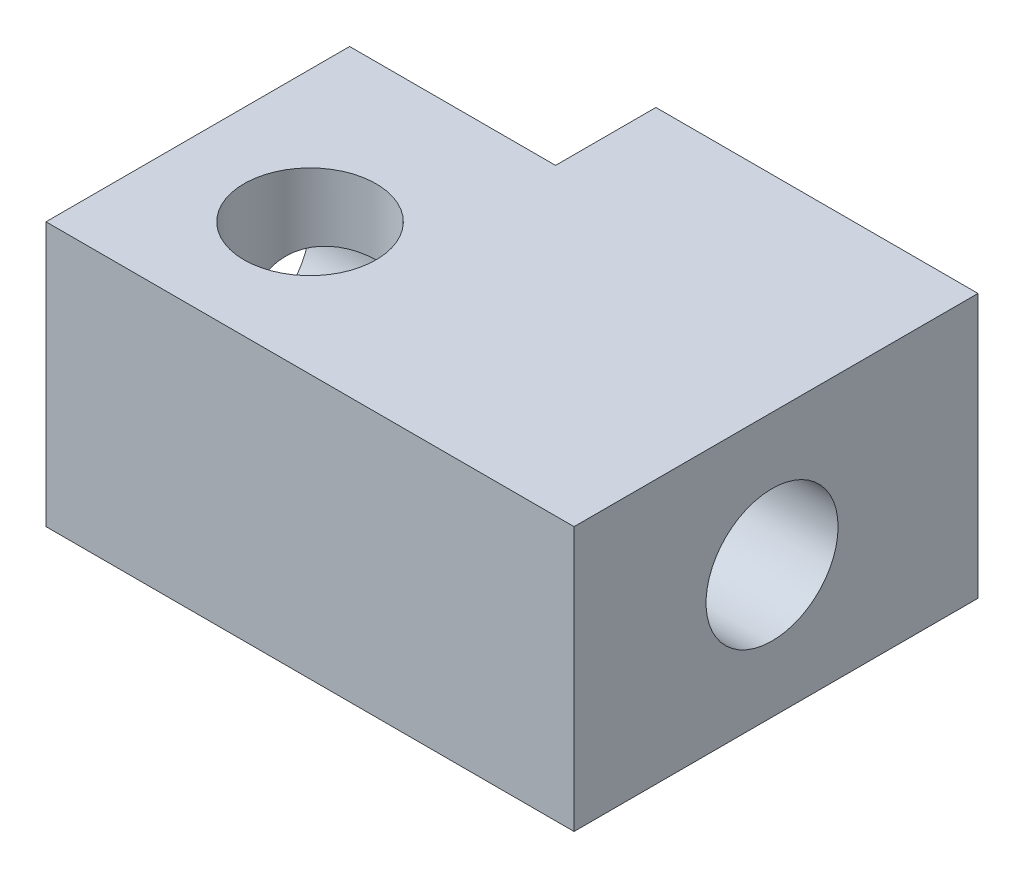
ISO-10303-21;
HEADER;
FILE_DESCRIPTION(('STEP AP214'),'2;1');
FILE_NAME('part.step','',(''),(''),'','','');
FILE_SCHEMA(('AUTOMOTIVE_DESIGN { 1 0 10303 214 1 1 1 1 }'));
ENDSEC;
DATA;
#1=APPLICATION_CONTEXT('core data for automotive mechanical design processes');
#2=APPLICATION_PROTOCOL_DEFINITION('international standard','automotive_design',2000,#1);
#3=PRODUCT_CONTEXT('',#1,'mechanical');
#4=PRODUCT('Part','Part','',(#3));
#5=PRODUCT_RELATED_PRODUCT_CATEGORY('part','',(#4));
#6=PRODUCT_DEFINITION_FORMATION('','',#4);
#7=PRODUCT_DEFINITION_CONTEXT('part definition',#1,'design');
#8=PRODUCT_DEFINITION('design','',#6,#7);
#9=PRODUCT_DEFINITION_SHAPE('','',#8);
#10=(LENGTH_UNIT() NAMED_UNIT(*) SI_UNIT(.MILLI.,.METRE.));
#11=(NAMED_UNIT(*) PLANE_ANGLE_UNIT() SI_UNIT($,.RADIAN.));
#12=(NAMED_UNIT(*) SI_UNIT($,.STERADIAN.) SOLID_ANGLE_UNIT());
#13=UNCERTAINTY_MEASURE_WITH_UNIT(LENGTH_MEASURE(1.E-05),#10,'distance_accuracy_value','');
#14=(GEOMETRIC_REPRESENTATION_CONTEXT(3) GLOBAL_UNCERTAINTY_ASSIGNED_CONTEXT((#13)) GLOBAL_UNIT_ASSIGNED_CONTEXT((#10,
#11,#12)) REPRESENTATION_CONTEXT('',''));
#15=CARTESIAN_POINT('',(0.,0.,0.));
#16=DIRECTION('',(0.,0.,1.));
#17=DIRECTION('',(1.,0.,0.));
#18=AXIS2_PLACEMENT_3D('',#15,#16,#17);
#19=CARTESIAN_POINT('',(89.,5.,0.));
#20=DIRECTION('',(1.,0.,0.));
#21=DIRECTION('',(0.,0.,-1.));
#22=AXIS2_PLACEMENT_3D('',#19,#20,#21);
#23=PLANE('',#22);
#24=CARTESIAN_POINT('',(89.,2.5,84.75));
#25=DIRECTION('',(1.,0.,0.));
#26=DIRECTION('',(0.,0.,-1.));
#27=AXIS2_PLACEMENT_3D('',#24,#25,#26);
#28=CIRCLE('',#27,1.25);
#29=CARTESIAN_POINT('',(89.,2.5,83.5));
#30=VERTEX_POINT('',#29);
#31=EDGE_CURVE('E193',#30,#30,#28,.T.);
#32=ORIENTED_EDGE('',*,*,#31,.F.);
#33=EDGE_LOOP('',(#32));
#34=FACE_BOUND('',#33,.T.);
#35=DIRECTION('',(0.,0.,1.));
#36=VECTOR('',#35,1.);
#37=CARTESIAN_POINT('',(89.,0.,0.));
#38=LINE('',#37,#36);
#39=CARTESIAN_POINT('',(89.,0.,80.85));
#40=VERTEX_POINT('',#39);
#41=CARTESIAN_POINT('',(89.,0.,88.5));
#42=VERTEX_POINT('',#41);
#43=EDGE_CURVE('E131',#40,#42,#38,.T.);
#44=ORIENTED_EDGE('',*,*,#43,.F.);
#45=DIRECTION('',(0.,-1.,0.));
#46=VECTOR('',#45,1.);
#47=CARTESIAN_POINT('',(89.,5.,80.85));
#48=LINE('',#47,#46);
#49=CARTESIAN_POINT('',(89.,5.,80.85));
#50=VERTEX_POINT('',#49);
#51=EDGE_CURVE('E11',#50,#40,#48,.T.);
#52=ORIENTED_EDGE('',*,*,#51,.F.);
#53=DIRECTION('',(0.,0.,1.));
#54=VECTOR('',#53,1.);
#55=CARTESIAN_POINT('',(89.,5.,0.));
#56=LINE('',#55,#54);
#57=CARTESIAN_POINT('',(89.,5.,88.5));
#58=VERTEX_POINT('',#57);
#59=EDGE_CURVE('E199',#50,#58,#56,.T.);
#60=ORIENTED_EDGE('',*,*,#59,.T.);
#61=DIRECTION('',(0.,-1.,0.));
#62=VECTOR('',#61,1.);
#63=CARTESIAN_POINT('',(89.,5.,88.5));
#64=LINE('',#63,#62);
#65=EDGE_CURVE('E88',#58,#42,#64,.T.);
#66=ORIENTED_EDGE('',*,*,#65,.T.);
#67=EDGE_LOOP('',(#44,#52,#60,#66));
#68=FACE_BOUND('',#67,.T.);
#69=ADVANCED_FACE('F36',(#34,#68),#23,.T.);
#70=CARTESIAN_POINT('',(0.,5.,80.85));
#71=DIRECTION('',(0.,0.,-1.));
#72=DIRECTION('',(-1.,0.,0.));
#73=AXIS2_PLACEMENT_3D('',#70,#71,#72);
#74=PLANE('',#73);
#75=DIRECTION('',(1.,0.,0.));
#76=VECTOR('',#75,1.);
#77=CARTESIAN_POINT('',(0.,0.,80.85));
#78=LINE('',#77,#76);
#79=CARTESIAN_POINT('',(82.9,0.,80.85));
#80=VERTEX_POINT('',#79);
#81=EDGE_CURVE('E133',#80,#40,#78,.T.);
#82=ORIENTED_EDGE('',*,*,#81,.F.);
#83=DIRECTION('',(0.,-1.,0.));
#84=VECTOR('',#83,1.);
#85=CARTESIAN_POINT('',(82.9,5.,80.85));
#86=LINE('',#85,#84);
#87=CARTESIAN_POINT('',(82.9,5.,80.85));
#88=VERTEX_POINT('',#87);
#89=EDGE_CURVE('E51',#88,#80,#86,.T.);
#90=ORIENTED_EDGE('',*,*,#89,.F.);
#91=DIRECTION('',(1.,0.,0.));
#92=VECTOR('',#91,1.);
#93=CARTESIAN_POINT('',(0.,5.,80.85));
#94=LINE('',#93,#92);
#95=EDGE_CURVE('E123',#88,#50,#94,.T.);
#96=ORIENTED_EDGE('',*,*,#95,.T.);
#97=ORIENTED_EDGE('',*,*,#51,.T.);
#98=EDGE_LOOP('',(#82,#90,#96,#97));
#99=FACE_BOUND('',#98,.T.);
#100=ADVANCED_FACE('F154',(#99),#74,.T.);
#101=CARTESIAN_POINT('',(82.9,5.,0.));
#102=DIRECTION('',(1.,0.,0.));
#103=DIRECTION('',(0.,0.,-1.));
#104=AXIS2_PLACEMENT_3D('',#101,#102,#103);
#105=PLANE('',#104);
#106=DIRECTION('',(0.,0.,1.));
#107=VECTOR('',#106,1.);
#108=CARTESIAN_POINT('',(82.9,0.,0.));
#109=LINE('',#108,#107);
#110=CARTESIAN_POINT('',(82.9,0.,82.75));
#111=VERTEX_POINT('',#110);
#112=EDGE_CURVE('E136',#80,#111,#109,.T.);
#113=ORIENTED_EDGE('',*,*,#112,.T.);
#114=DIRECTION('',(0.,-1.,0.));
#115=VECTOR('',#114,1.);
#116=CARTESIAN_POINT('',(82.9,5.,82.75));
#117=LINE('',#116,#115);
#118=CARTESIAN_POINT('',(82.9,5.,82.75));
#119=VERTEX_POINT('',#118);
#120=EDGE_CURVE('E110',#119,#111,#117,.T.);
#121=ORIENTED_EDGE('',*,*,#120,.F.);
#122=DIRECTION('',(0.,0.,1.));
#123=VECTOR('',#122,1.);
#124=CARTESIAN_POINT('',(82.9,5.,0.));
#125=LINE('',#124,#123);
#126=EDGE_CURVE('E120',#88,#119,#125,.T.);
#127=ORIENTED_EDGE('',*,*,#126,.F.);
#128=ORIENTED_EDGE('',*,*,#89,.T.);
#129=EDGE_LOOP('',(#113,#121,#127,#128));
#130=FACE_BOUND('',#129,.T.);
#131=ADVANCED_FACE('F149',(#130),#105,.F.);
#132=CARTESIAN_POINT('',(0.,5.,82.75));
#133=DIRECTION('',(0.,0.,-1.));
#134=DIRECTION('',(-1.,0.,0.));
#135=AXIS2_PLACEMENT_3D('',#132,#133,#134);
#136=PLANE('',#135);
#137=DIRECTION('',(1.,0.,0.));
#138=VECTOR('',#137,1.);
#139=CARTESIAN_POINT('',(0.,0.,82.75));
#140=LINE('',#139,#138);
#141=CARTESIAN_POINT('',(79.,0.,82.75));
#142=VERTEX_POINT('',#141);
#143=EDGE_CURVE('E107',#142,#111,#140,.T.);
#144=ORIENTED_EDGE('',*,*,#143,.F.);
#145=DIRECTION('',(0.,-1.,0.));
#146=VECTOR('',#145,1.);
#147=CARTESIAN_POINT('',(79.,5.,82.75));
#148=LINE('',#147,#146);
#149=CARTESIAN_POINT('',(79.,5.,82.75));
#150=VERTEX_POINT('',#149);
#151=EDGE_CURVE('E101',#150,#142,#148,.T.);
#152=ORIENTED_EDGE('',*,*,#151,.F.);
#153=DIRECTION('',(1.,0.,0.));
#154=VECTOR('',#153,1.);
#155=CARTESIAN_POINT('',(0.,5.,82.75));
#156=LINE('',#155,#154);
#157=EDGE_CURVE('E105',#150,#119,#156,.T.);
#158=ORIENTED_EDGE('',*,*,#157,.T.);
#159=ORIENTED_EDGE('',*,*,#120,.T.);
#160=EDGE_LOOP('',(#144,#152,#158,#159));
#161=FACE_BOUND('',#160,.T.);
#162=ADVANCED_FACE('F103',(#161),#136,.T.);
#163=CARTESIAN_POINT('',(79.,5.,0.));
#164=DIRECTION('',(1.,0.,0.));
#165=DIRECTION('',(0.,0.,-1.));
#166=AXIS2_PLACEMENT_3D('',#163,#164,#165);
#167=PLANE('',#166);
#168=CARTESIAN_POINT('',(79.,2.5,84.75));
#169=DIRECTION('',(1.,0.,0.));
#170=DIRECTION('',(0.,0.,-1.));
#171=AXIS2_PLACEMENT_3D('',#168,#169,#170);
#172=CIRCLE('',#171,1.25);
#173=CARTESIAN_POINT('',(79.,2.5,83.5));
#174=VERTEX_POINT('',#173);
#175=EDGE_CURVE('E191',#174,#174,#172,.T.);
#176=ORIENTED_EDGE('',*,*,#175,.T.);
#177=EDGE_LOOP('',(#176));
#178=FACE_BOUND('',#177,.T.);
#179=DIRECTION('',(0.,0.,1.));
#180=VECTOR('',#179,1.);
#181=CARTESIAN_POINT('',(79.,0.,0.));
#182=LINE('',#181,#180);
#183=CARTESIAN_POINT('',(79.,0.,88.5));
#184=VERTEX_POINT('',#183);
#185=EDGE_CURVE('E140',#142,#184,#182,.T.);
#186=ORIENTED_EDGE('',*,*,#185,.T.);
#187=DIRECTION('',(0.,-1.,0.));
#188=VECTOR('',#187,1.);
#189=CARTESIAN_POINT('',(79.,5.,88.5));
#190=LINE('',#189,#188);
#191=CARTESIAN_POINT('',(79.,5.,88.5));
#192=VERTEX_POINT('',#191);
#193=EDGE_CURVE('E111',#192,#184,#190,.T.);
#194=ORIENTED_EDGE('',*,*,#193,.F.);
#195=DIRECTION('',(0.,0.,1.));
#196=VECTOR('',#195,1.);
#197=CARTESIAN_POINT('',(79.,5.,0.));
#198=LINE('',#197,#196);
#199=EDGE_CURVE('E114',#150,#192,#198,.T.);
#200=ORIENTED_EDGE('',*,*,#199,.F.);
#201=ORIENTED_EDGE('',*,*,#151,.T.);
#202=EDGE_LOOP('',(#186,#194,#200,#201));
#203=FACE_BOUND('',#202,.T.);
#204=ADVANCED_FACE('F115',(#178,#203),#167,.F.);
#205=CARTESIAN_POINT('',(81.5000000000009,5.,86.));
#206=DIRECTION('',(0.,-1.,0.));
#207=DIRECTION('',(0.,0.,-1.));
#208=AXIS2_PLACEMENT_3D('',#205,#206,#207);
#209=CYLINDRICAL_SURFACE('',#208,1.25);
#210=CARTESIAN_POINT('',(81.5000000000009,3.75,84.75));
#211=CARTESIAN_POINT('',(81.4303879179771,3.7500033558061,84.7500021347025));
#212=CARTESIAN_POINT('',(81.3607520893775,3.75004170118305,84.7558313770004));
#213=CARTESIAN_POINT('',(81.2233776214595,3.74971562826646,84.7790008984842));
#214=CARTESIAN_POINT('',(81.1556405249972,3.74935089164191,84.7963502712858));
#215=CARTESIAN_POINT('',(81.0239309211144,3.74681223178613,84.8421042621616));
#216=CARTESIAN_POINT('',(80.9599632382152,3.74463604169126,84.8705227084195));
#217=CARTESIAN_POINT('',(80.8378405970693,3.73631466046053,84.9375091377932));
#218=CARTESIAN_POINT('',(80.7796835225878,3.73017092044326,84.9760734070522));
#219=CARTESIAN_POINT('',(80.6733131867562,3.71166627926563,85.0600558017887));
#220=CARTESIAN_POINT('',(80.6247992425869,3.69955884502475,85.1051455344101));
#221=CARTESIAN_POINT('',(80.5367504135997,3.66699666627188,85.200717403511));
#222=CARTESIAN_POINT('',(80.4972009142168,3.64655566235215,85.2511905629941));
#223=CARTESIAN_POINT('',(80.432780674381,3.59934157849851,85.3469924673292));
#224=CARTESIAN_POINT('',(80.4066448044918,3.5738087266144,85.3920865869244));
#225=CARTESIAN_POINT('',(80.3617051656157,3.51530466467924,85.4810868318676));
#226=CARTESIAN_POINT('',(80.3429015945137,3.48233325391342,85.5249929251232));
#227=CARTESIAN_POINT('',(80.3126951216891,3.41167129701442,85.6068025573928));
#228=CARTESIAN_POINT('',(80.3009266541825,3.37436469301847,85.6449064713919));
#229=CARTESIAN_POINT('',(80.2820117652387,3.29452710556952,85.716490897934));
#230=CARTESIAN_POINT('',(80.2748668564855,3.25199441771504,85.7499698945337));
#231=CARTESIAN_POINT('',(80.2633928519259,3.1582338097136,85.814318134905));
#232=CARTESIAN_POINT('',(80.2594124835201,3.1065619286813,85.8446010281685));
#233=CARTESIAN_POINT('',(80.253924793901,2.99931042312478,85.8975065401068));
#234=CARTESIAN_POINT('',(80.252418814643,2.94372869516968,85.9201249967918));
#235=CARTESIAN_POINT('',(80.2504800179322,2.82274720210579,85.9594904995483));
#236=CARTESIAN_POINT('',(80.2502048850909,2.75698867064901,85.9751501386427));
#237=CARTESIAN_POINT('',(80.2499653142809,2.62380822483295,85.9956784117589));
#238=CARTESIAN_POINT('',(80.2500009294372,2.55638602802008,86.0005452004692));
#239=CARTESIAN_POINT('',(80.2499990340441,2.41883941795819,85.9993335565702));
#240=CARTESIAN_POINT('',(80.2499584390909,2.3487185389928,85.9927942534782));
#241=CARTESIAN_POINT('',(80.2503482333396,2.21054143998912,85.9680487393185));
#242=CARTESIAN_POINT('',(80.2507788017529,2.14248601568742,85.9498380900396));
#243=CARTESIAN_POINT('',(80.2536006462434,2.01035190660498,85.902249581801));
#244=CARTESIAN_POINT('',(80.2559937470638,1.94627698252351,85.8728613436709));
#245=CARTESIAN_POINT('',(80.2649934437987,1.82417323358955,85.8038810242477));
#246=CARTESIAN_POINT('',(80.2715983615576,1.76614201139396,85.7642930106933));
#247=CARTESIAN_POINT('',(80.2912111729234,1.66087589652267,85.6788332669613));
#248=CARTESIAN_POINT('',(80.3038824976315,1.61324633060538,85.6333745589749));
#249=CARTESIAN_POINT('',(80.3376608817984,1.52700943350309,85.5373592401222));
#250=CARTESIAN_POINT('',(80.3587540369895,1.48838739674516,85.4868111341065));
#251=CARTESIAN_POINT('',(80.4071278732192,1.42569483722976,85.3912360325712));
#252=CARTESIAN_POINT('',(80.4331601351102,1.40035405930868,85.3464047503039));
#253=CARTESIAN_POINT('',(80.4925538056876,1.35687664120273,85.258124954786));
#254=CARTESIAN_POINT('',(80.5259157889991,1.33874056615512,85.2146765502543));
#255=CARTESIAN_POINT('',(80.5974444640301,1.30956813041756,85.1335877685098));
#256=CARTESIAN_POINT('',(80.6352781255362,1.29821607958066,85.0957639884471));
#257=CARTESIAN_POINT('',(80.7161063517365,1.28004280044354,85.0248566298701));
#258=CARTESIAN_POINT('',(80.7591026229588,1.27322307522254,84.9917746267463));
#259=CARTESIAN_POINT('',(80.8539609749728,1.26230566363697,84.9282160395455));
#260=CARTESIAN_POINT('',(80.9062800841769,1.25856219304606,84.8983621961734));
#261=CARTESIAN_POINT('',(81.0147650771944,1.2534536227878,84.8464534516357));
#262=CARTESIAN_POINT('',(81.0709330202005,1.25208980676652,84.8244027647997));
#263=CARTESIAN_POINT('',(81.1929463513506,1.25036639768356,84.7864174144587));
#264=CARTESIAN_POINT('',(81.2591333554211,1.25015061471084,84.771565676944));
#265=CARTESIAN_POINT('',(81.3930370260497,1.24996763393157,84.752749658674));
#266=CARTESIAN_POINT('',(81.4607539362298,1.2500004759982,84.7487871244107));
#267=CARTESIAN_POINT('',(81.598523850086,1.2499995901791,84.7519144510518));
#268=CARTESIAN_POINT('',(81.6685676216663,1.24996327980412,84.7594309137238));
#269=CARTESIAN_POINT('',(81.8064279917303,1.25045151296893,84.786108011309));
#270=CARTESIAN_POINT('',(81.8742437016072,1.25097627754662,84.8052732340174));
#271=CARTESIAN_POINT('',(82.0056941376746,1.25414747737535,84.8547033903236));
#272=CARTESIAN_POINT('',(82.0693274802368,1.2567946109728,84.8849719756042));
#273=CARTESIAN_POINT('',(82.1903790430181,1.26651155906023,84.955597663157));
#274=CARTESIAN_POINT('',(82.2478002772486,1.27357921739481,84.9959498412971));
#275=CARTESIAN_POINT('',(82.3514864638537,1.29426432070599,85.0825152442898));
#276=CARTESIAN_POINT('',(82.3981878638404,1.30750532176261,85.1282913040849));
#277=CARTESIAN_POINT('',(82.4825454071386,1.34249213800241,85.224637838345));
#278=CARTESIAN_POINT('',(82.5202159173548,1.36422429808701,85.2752005167561));
#279=CARTESIAN_POINT('',(82.5811827113211,1.41373028414858,85.370476848518));
#280=CARTESIAN_POINT('',(82.6057452197654,1.44025655763787,85.4150347952149));
#281=CARTESIAN_POINT('',(82.6477946163517,1.50052783570434,85.5025797802186));
#282=CARTESIAN_POINT('',(82.6652806615349,1.53427369955843,85.5455666308196));
#283=CARTESIAN_POINT('',(82.6934458385397,1.6066691447876,85.6259332987859));
#284=CARTESIAN_POINT('',(82.7043916578275,1.64503607956333,85.6634769604646));
#285=CARTESIAN_POINT('',(82.7218426880378,1.72686928004555,85.7337072277934));
#286=CARTESIAN_POINT('',(82.72834639432,1.77033726775321,85.7663921847646));
#287=CARTESIAN_POINT('',(82.738721291342,1.86630353774615,85.8291473122166));
#288=CARTESIAN_POINT('',(82.7422344697995,1.91927026078922,85.8585590163));
#289=CARTESIAN_POINT('',(82.746977750713,2.02898758021986,85.9094441664789));
#290=CARTESIAN_POINT('',(82.748206632873,2.08574018230667,85.9309133646988));
#291=CARTESIAN_POINT('',(82.7497291750199,2.20876476667335,85.967487964113));
#292=CARTESIAN_POINT('',(82.7498925745441,2.2753607066057,85.9815173891319));
#293=CARTESIAN_POINT('',(82.7500283388499,2.4099455326734,85.9985970916655));
#294=CARTESIAN_POINT('',(82.7500006746444,2.47793462860937,86.0016457031347));
#295=CARTESIAN_POINT('',(82.7499987320161,2.61588728113225,85.9965942638138));
#296=CARTESIAN_POINT('',(82.7500263526798,2.68583682330674,85.9881009540032));
#297=CARTESIAN_POINT('',(82.7494243784368,2.82334632856864,85.9594963411097));
#298=CARTESIAN_POINT('',(82.7487945166503,2.89090530978676,85.9393803217148));
#299=CARTESIAN_POINT('',(82.7452472993218,3.02163651082605,85.8881220793566));
#300=CARTESIAN_POINT('',(82.7423306345141,3.08481004900975,85.856983187436));
#301=CARTESIAN_POINT('',(82.7318635971329,3.20477345591417,85.7847391093132));
#302=CARTESIAN_POINT('',(82.7243159133323,3.26156700623996,85.7436397145574));
#303=CARTESIAN_POINT('',(82.7025343613422,3.36364132852684,85.6560220190676));
#304=CARTESIAN_POINT('',(82.688719128613,3.40940230321813,85.6099636260909));
#305=CARTESIAN_POINT('',(82.6525274308278,3.49186734215067,85.513358208184));
#306=CARTESIAN_POINT('',(82.6301642341435,3.52858529867647,85.4628182325949));
#307=CARTESIAN_POINT('',(82.5795430940293,3.58784921953403,85.3678844384003));
#308=CARTESIAN_POINT('',(82.5525268645314,3.61165244808969,85.3236064570709));
#309=CARTESIAN_POINT('',(82.4913864440221,3.65231087075098,85.2368038839194));
#310=CARTESIAN_POINT('',(82.457261309833,3.66916514201503,85.1942795256579));
#311=CARTESIAN_POINT('',(82.3839982562647,3.69634915173573,85.1146358971997));
#312=CARTESIAN_POINT('',(82.3450938332179,3.70689813748655,85.0773744649223));
#313=CARTESIAN_POINT('',(82.2622414317477,3.72364610948475,85.0078217986497));
#314=CARTESIAN_POINT('',(82.2182912233533,3.72984316373062,84.9755327770719));
#315=CARTESIAN_POINT('',(82.1211953593632,3.73969059486377,84.9135876316312));
#316=CARTESIAN_POINT('',(82.067570797015,3.74298006728529,84.8846262673125));
#317=CARTESIAN_POINT('',(81.9566175620933,3.74737215732311,84.8347952522022));
#318=CARTESIAN_POINT('',(81.8992885534449,3.74847457623702,84.8139263367799));
#319=CARTESIAN_POINT('',(81.7854074822083,3.74969754606906,84.7816605541001));
#320=CARTESIAN_POINT('',(81.7289844384262,3.74986850415371,84.7698080281505));
#321=CARTESIAN_POINT('',(81.6150463939637,3.7500183520458,84.7539765558046));
#322=CARTESIAN_POINT('',(81.5575313067839,3.74999722657469,84.7499982357628));
#323=CARTESIAN_POINT('',(81.5000000000009,3.75,84.75));
#324=B_SPLINE_CURVE_WITH_KNOTS('',3,(#210,#211,#212,#213,#214,#215,#216,#217,#218,#219,#220,
#221,#222,#223,#224,#225,#226,#227,#228,#229,#230,#231,#232,#233,#234,#235,#236,#237,#238,#239,
#240,#241,#242,#243,#244,#245,#246,#247,#248,#249,#250,#251,#252,#253,#254,#255,#256,#257,#258,
#259,#260,#261,#262,#263,#264,#265,#266,#267,#268,#269,#270,#271,#272,#273,#274,#275,#276,#277,
#278,#279,#280,#281,#282,#283,#284,#285,#286,#287,#288,#289,#290,#291,#292,#293,#294,#295,#296,
#297,#298,#299,#300,#301,#302,#303,#304,#305,#306,#307,#308,#309,#310,#311,#312,#313,#314,#315,
#316,#317,#318,#319,#320,#321,#322,#323),.UNSPECIFIED.,.T.,.F.,(4,2,2,2,2,2,2,2,2,2,2,2,2,2,2,2,
2,2,2,2,2,2,2,2,2,2,2,2,2,2,2,2,2,2,2,2,2,2,2,2,2,2,2,2,2,2,2,2,2,2,2,2,2,2,2,2,4),(0.,
0.208635853058993,0.417436592556168,0.62649902005571,0.835485026919861,1.03626900279049,
1.2367232515091,1.40989905564516,1.58307953314629,1.74622940236772,1.90943262217829,
2.08879044033088,2.26824549897723,2.47013348722585,2.67205599068608,2.88232735327898,
3.09267872231269,3.30322589602161,3.51368923173188,3.71363214752704,3.91324631771991,
4.08543282663772,4.2576328392086,4.42102516331617,4.5844716470846,4.76481230506923,
4.94525021334122,5.14783584231474,5.35045396159617,5.56078743163859,5.77120379400175,
5.98168942040357,6.19207246030312,6.39103309312866,6.58967507471359,6.76090552970105,
6.93215637591606,7.09583847723657,7.25957599378235,7.44090954126655,7.62233993130791,
7.82559178979602,8.02887448503354,8.23925993141408,8.4497308089038,8.66013813764083,
8.87042341917871,9.0683608042588,9.26599218535635,9.43631189364912,9.60665421361014,
9.77066437891941,9.93474730914123,10.1171215855153,10.2995124305503,10.4719270207555,
10.6443553251434),.UNSPECIFIED.);
#325=CARTESIAN_POINT('',(81.5000000000009,3.75,84.75));
#326=VERTEX_POINT('',#325);
#327=EDGE_CURVE('E41',#326,#326,#324,.T.);
#328=ORIENTED_EDGE('',*,*,#327,.F.);
#329=EDGE_LOOP('',(#328));
#330=FACE_BOUND('',#329,.T.);
#331=CARTESIAN_POINT('',(81.5000000000009,5.,86.));
#332=DIRECTION('',(0.,1.,0.));
#333=DIRECTION('',(0.,0.,1.));
#334=AXIS2_PLACEMENT_3D('',#331,#332,#333);
#335=CIRCLE('',#334,1.25);
#336=CARTESIAN_POINT('',(81.5000000000009,5.,87.25));
#337=VERTEX_POINT('',#336);
#338=EDGE_CURVE('E143',#337,#337,#335,.T.);
#339=ORIENTED_EDGE('',*,*,#338,.T.);
#340=EDGE_LOOP('',(#339));
#341=FACE_BOUND('',#340,.T.);
#342=CARTESIAN_POINT('',(81.5000000000009,0.,86.));
#343=DIRECTION('',(0.,1.,0.));
#344=DIRECTION('',(0.,0.,1.));
#345=AXIS2_PLACEMENT_3D('',#342,#343,#344);
#346=CIRCLE('',#345,1.25);
#347=CARTESIAN_POINT('',(81.5000000000009,0.,87.25));
#348=VERTEX_POINT('',#347);
#349=EDGE_CURVE('E128',#348,#348,#346,.T.);
#350=ORIENTED_EDGE('',*,*,#349,.F.);
#351=EDGE_LOOP('',(#350));
#352=FACE_BOUND('',#351,.T.);
#353=ADVANCED_FACE('F38',(#330,#341,#352),#209,.F.);
#354=CARTESIAN_POINT('',(0.,5.,88.5));
#355=DIRECTION('',(0.,0.,-1.));
#356=DIRECTION('',(-1.,0.,0.));
#357=AXIS2_PLACEMENT_3D('',#354,#355,#356);
#358=PLANE('',#357);
#359=DIRECTION('',(1.,0.,0.));
#360=VECTOR('',#359,1.);
#361=CARTESIAN_POINT('',(0.,0.,88.5));
#362=LINE('',#361,#360);
#363=EDGE_CURVE('E81',#184,#42,#362,.T.);
#364=ORIENTED_EDGE('',*,*,#363,.T.);
#365=ORIENTED_EDGE('',*,*,#65,.F.);
#366=DIRECTION('',(1.,0.,0.));
#367=VECTOR('',#366,1.);
#368=CARTESIAN_POINT('',(0.,5.,88.5));
#369=LINE('',#368,#367);
#370=EDGE_CURVE('E59',#192,#58,#369,.T.);
#371=ORIENTED_EDGE('',*,*,#370,.F.);
#372=ORIENTED_EDGE('',*,*,#193,.T.);
#373=EDGE_LOOP('',(#364,#365,#371,#372));
#374=FACE_BOUND('',#373,.T.);
#375=ADVANCED_FACE('F170',(#374),#358,.F.);
#376=CARTESIAN_POINT('',(0.,5.,0.));
#377=DIRECTION('',(0.,1.,0.));
#378=DIRECTION('',(0.,0.,1.));
#379=AXIS2_PLACEMENT_3D('',#376,#377,#378);
#380=PLANE('',#379);
#381=ORIENTED_EDGE('',*,*,#338,.F.);
#382=EDGE_LOOP('',(#381));
#383=FACE_BOUND('',#382,.T.);
#384=ORIENTED_EDGE('',*,*,#59,.F.);
#385=ORIENTED_EDGE('',*,*,#95,.F.);
#386=ORIENTED_EDGE('',*,*,#126,.T.);
#387=ORIENTED_EDGE('',*,*,#157,.F.);
#388=ORIENTED_EDGE('',*,*,#199,.T.);
#389=ORIENTED_EDGE('',*,*,#370,.T.);
#390=EDGE_LOOP('',(#384,#385,#386,#387,#388,#389));
#391=FACE_BOUND('',#390,.T.);
#392=ADVANCED_FACE('F117',(#383,#391),#380,.T.);
#393=CARTESIAN_POINT('',(0.,0.,0.));
#394=DIRECTION('',(0.,1.,0.));
#395=DIRECTION('',(0.,0.,1.));
#396=AXIS2_PLACEMENT_3D('',#393,#394,#395);
#397=PLANE('',#396);
#398=ORIENTED_EDGE('',*,*,#349,.T.);
#399=EDGE_LOOP('',(#398));
#400=FACE_BOUND('',#399,.T.);
#401=ORIENTED_EDGE('',*,*,#43,.T.);
#402=ORIENTED_EDGE('',*,*,#363,.F.);
#403=ORIENTED_EDGE('',*,*,#185,.F.);
#404=ORIENTED_EDGE('',*,*,#143,.T.);
#405=ORIENTED_EDGE('',*,*,#112,.F.);
#406=ORIENTED_EDGE('',*,*,#81,.T.);
#407=EDGE_LOOP('',(#401,#402,#403,#404,#405,#406));
#408=FACE_BOUND('',#407,.T.);
#409=ADVANCED_FACE('F153',(#400,#408),#397,.F.);
#410=CARTESIAN_POINT('',(79.,2.5,84.75));
#411=DIRECTION('',(1.,0.,0.));
#412=DIRECTION('',(0.,0.,-1.));
#413=AXIS2_PLACEMENT_3D('',#410,#411,#412);
#414=CYLINDRICAL_SURFACE('',#413,1.25);
#415=ORIENTED_EDGE('',*,*,#327,.T.);
#416=EDGE_LOOP('',(#415));
#417=FACE_BOUND('',#416,.T.);
#418=ORIENTED_EDGE('',*,*,#175,.F.);
#419=EDGE_LOOP('',(#418));
#420=FACE_BOUND('',#419,.T.);
#421=ORIENTED_EDGE('',*,*,#31,.T.);
#422=EDGE_LOOP('',(#421));
#423=FACE_BOUND('',#422,.T.);
#424=ADVANCED_FACE('F176',(#417,#420,#423),#414,.F.);
#425=CLOSED_SHELL('',(#69,#100,#131,#162,#204,#353,#375,#392,#409,#424));
#426=MANIFOLD_SOLID_BREP('B2',#425);
#427=ADVANCED_BREP_SHAPE_REPRESENTATION('',(#18,#426),#14);
#428=SHAPE_DEFINITION_REPRESENTATION(#9,#427);
ENDSEC;
END-ISO-10303-21;
